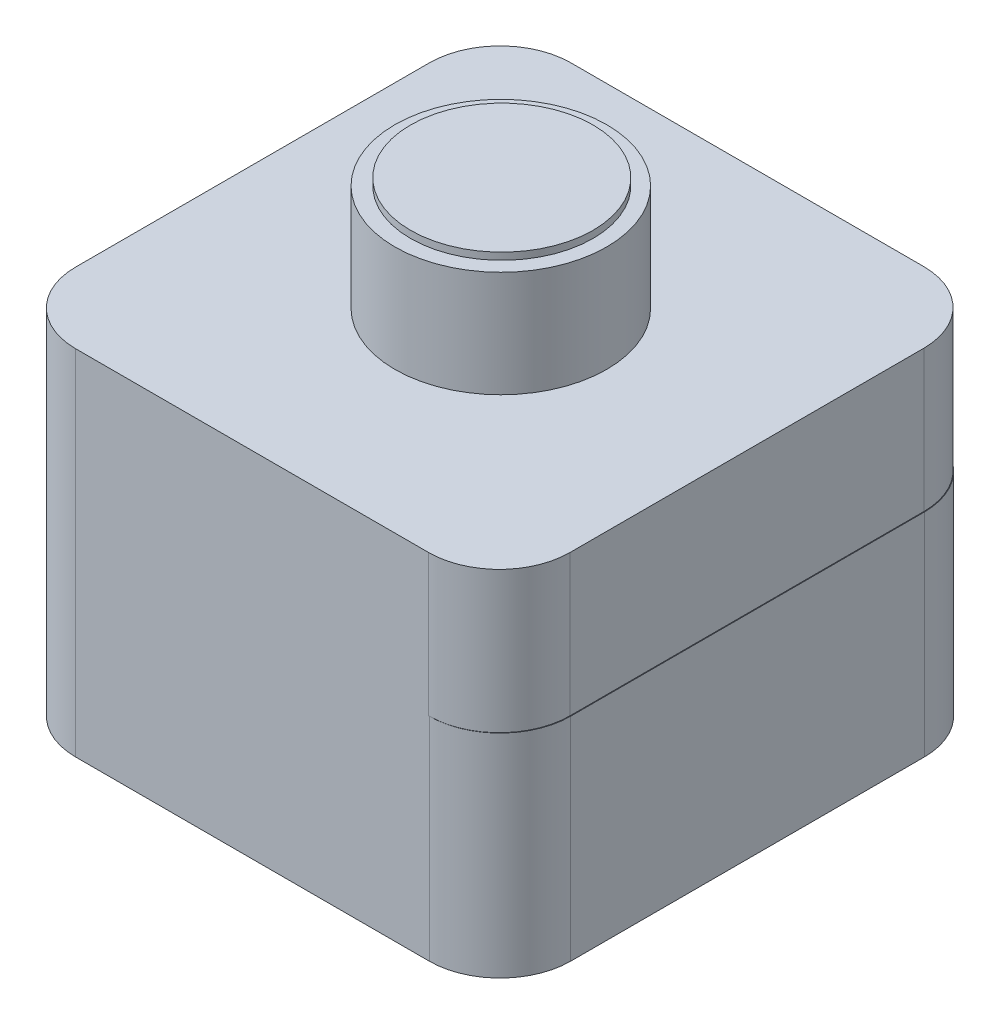
ISO-10303-21;
HEADER;
FILE_DESCRIPTION(('STEP AP214'),'2;1');
FILE_NAME('part.step','',(''),(''),'','','');
FILE_SCHEMA(('AUTOMOTIVE_DESIGN { 1 0 10303 214 1 1 1 1 }'));
ENDSEC;
DATA;
#1=APPLICATION_CONTEXT('core data for automotive mechanical design processes');
#2=APPLICATION_PROTOCOL_DEFINITION('international standard','automotive_design',2000,#1);
#3=PRODUCT_CONTEXT('',#1,'mechanical');
#4=PRODUCT('Part','Part','',(#3));
#5=PRODUCT_RELATED_PRODUCT_CATEGORY('part','',(#4));
#6=PRODUCT_DEFINITION_FORMATION('','',#4);
#7=PRODUCT_DEFINITION_CONTEXT('part definition',#1,'design');
#8=PRODUCT_DEFINITION('design','',#6,#7);
#9=PRODUCT_DEFINITION_SHAPE('','',#8);
#10=(LENGTH_UNIT() NAMED_UNIT(*) SI_UNIT(.MILLI.,.METRE.));
#11=(NAMED_UNIT(*) PLANE_ANGLE_UNIT() SI_UNIT($,.RADIAN.));
#12=(NAMED_UNIT(*) SI_UNIT($,.STERADIAN.) SOLID_ANGLE_UNIT());
#13=UNCERTAINTY_MEASURE_WITH_UNIT(LENGTH_MEASURE(1.E-05),#10,'distance_accuracy_value','');
#14=(GEOMETRIC_REPRESENTATION_CONTEXT(3) GLOBAL_UNCERTAINTY_ASSIGNED_CONTEXT((#13)) GLOBAL_UNIT_ASSIGNED_CONTEXT((#10,
#11,#12)) REPRESENTATION_CONTEXT('',''));
#15=CARTESIAN_POINT('',(0.,0.,0.));
#16=DIRECTION('',(0.,0.,1.));
#17=DIRECTION('',(1.,0.,0.));
#18=AXIS2_PLACEMENT_3D('',#15,#16,#17);
#19=CARTESIAN_POINT('',(60.,30.,-10.));
#20=DIRECTION('',(0.,-1.,0.));
#21=DIRECTION('',(0.,0.,-1.));
#22=AXIS2_PLACEMENT_3D('',#19,#20,#21);
#23=CYLINDRICAL_SURFACE('',#22,10.);
#24=CARTESIAN_POINT('',(60.,0.,-10.));
#25=DIRECTION('',(0.,1.,0.));
#26=DIRECTION('',(0.,0.,1.));
#27=AXIS2_PLACEMENT_3D('',#24,#25,#26);
#28=CIRCLE('',#27,10.);
#29=CARTESIAN_POINT('',(59.9999999999999,0.,0.));
#30=VERTEX_POINT('',#29);
#31=CARTESIAN_POINT('',(70.,0.,-10.0000000000001));
#32=VERTEX_POINT('',#31);
#33=EDGE_CURVE('E167',#30,#32,#28,.T.);
#34=ORIENTED_EDGE('',*,*,#33,.T.);
#35=DIRECTION('',(0.,-1.,0.));
#36=VECTOR('',#35,1.);
#37=CARTESIAN_POINT('',(70.,30.,-10.0000000000001));
#38=LINE('',#37,#36);
#39=CARTESIAN_POINT('',(70.,30.,-10.0000000000001));
#40=VERTEX_POINT('',#39);
#41=EDGE_CURVE('E44',#40,#32,#38,.T.);
#42=ORIENTED_EDGE('',*,*,#41,.F.);
#43=CARTESIAN_POINT('',(60.,30.,-10.));
#44=DIRECTION('',(0.,1.,0.));
#45=DIRECTION('',(0.,0.,1.));
#46=AXIS2_PLACEMENT_3D('',#43,#44,#45);
#47=CIRCLE('',#46,10.);
#48=CARTESIAN_POINT('',(59.9999999999999,30.,0.));
#49=VERTEX_POINT('',#48);
#50=EDGE_CURVE('E176',#49,#40,#47,.T.);
#51=ORIENTED_EDGE('',*,*,#50,.F.);
#52=DIRECTION('',(0.,-1.,0.));
#53=VECTOR('',#52,1.);
#54=CARTESIAN_POINT('',(59.9999999999999,30.,0.));
#55=LINE('',#54,#53);
#56=EDGE_CURVE('E193',#49,#30,#55,.T.);
#57=ORIENTED_EDGE('',*,*,#56,.T.);
#58=EDGE_LOOP('',(#34,#42,#51,#57));
#59=FACE_BOUND('',#58,.T.);
#60=ADVANCED_FACE('F41',(#59),#23,.T.);
#61=CARTESIAN_POINT('',(70.,30.,-10.0000000000001));
#62=DIRECTION('',(-1.,0.,0.));
#63=DIRECTION('',(0.,0.,1.));
#64=AXIS2_PLACEMENT_3D('',#61,#62,#63);
#65=PLANE('',#64);
#66=DIRECTION('',(0.,0.,-1.));
#67=VECTOR('',#66,1.);
#68=CARTESIAN_POINT('',(70.,0.,-10.0000000000001));
#69=LINE('',#68,#67);
#70=CARTESIAN_POINT('',(70.,0.,-59.9999999999999));
#71=VERTEX_POINT('',#70);
#72=EDGE_CURVE('E170',#32,#71,#69,.T.);
#73=ORIENTED_EDGE('',*,*,#72,.T.);
#74=DIRECTION('',(0.,-1.,0.));
#75=VECTOR('',#74,1.);
#76=CARTESIAN_POINT('',(70.,30.,-59.9999999999999));
#77=LINE('',#76,#75);
#78=CARTESIAN_POINT('',(70.,30.,-59.9999999999999));
#79=VERTEX_POINT('',#78);
#80=EDGE_CURVE('E223',#79,#71,#77,.T.);
#81=ORIENTED_EDGE('',*,*,#80,.F.);
#82=DIRECTION('',(0.,0.,-1.));
#83=VECTOR('',#82,1.);
#84=CARTESIAN_POINT('',(70.,30.,-10.0000000000001));
#85=LINE('',#84,#83);
#86=EDGE_CURVE('E179',#40,#79,#85,.T.);
#87=ORIENTED_EDGE('',*,*,#86,.F.);
#88=ORIENTED_EDGE('',*,*,#41,.T.);
#89=EDGE_LOOP('',(#73,#81,#87,#88));
#90=FACE_BOUND('',#89,.T.);
#91=ADVANCED_FACE('F305',(#90),#65,.F.);
#92=CARTESIAN_POINT('',(60.,30.,-60.));
#93=DIRECTION('',(0.,-1.,0.));
#94=DIRECTION('',(0.,0.,-1.));
#95=AXIS2_PLACEMENT_3D('',#92,#93,#94);
#96=CYLINDRICAL_SURFACE('',#95,9.99999999999999);
#97=CARTESIAN_POINT('',(60.,0.,-60.));
#98=DIRECTION('',(0.,1.,0.));
#99=DIRECTION('',(0.,0.,-1.));
#100=AXIS2_PLACEMENT_3D('',#97,#98,#99);
#101=CIRCLE('',#100,9.99999999999999);
#102=CARTESIAN_POINT('',(59.9999999999999,0.,-70.));
#103=VERTEX_POINT('',#102);
#104=EDGE_CURVE('E196',#71,#103,#101,.T.);
#105=ORIENTED_EDGE('',*,*,#104,.T.);
#106=DIRECTION('',(0.,-1.,0.));
#107=VECTOR('',#106,1.);
#108=CARTESIAN_POINT('',(59.9999999999999,30.,-70.));
#109=LINE('',#108,#107);
#110=CARTESIAN_POINT('',(59.9999999999999,30.,-70.));
#111=VERTEX_POINT('',#110);
#112=EDGE_CURVE('E221',#111,#103,#109,.T.);
#113=ORIENTED_EDGE('',*,*,#112,.F.);
#114=CARTESIAN_POINT('',(60.,30.,-60.));
#115=DIRECTION('',(0.,1.,0.));
#116=DIRECTION('',(0.,0.,-1.));
#117=AXIS2_PLACEMENT_3D('',#114,#115,#116);
#118=CIRCLE('',#117,9.99999999999999);
#119=CARTESIAN_POINT('',(62.2621964023049,30.,-69.7407631855722));
#120=VERTEX_POINT('',#119);
#121=EDGE_CURVE('E182',#120,#111,#118,.T.);
#122=ORIENTED_EDGE('',*,*,#121,.F.);
#123=EDGE_CURVE('E183',#79,#120,#118,.T.);
#124=ORIENTED_EDGE('',*,*,#123,.F.);
#125=ORIENTED_EDGE('',*,*,#80,.T.);
#126=EDGE_LOOP('',(#105,#113,#122,#124,#125));
#127=FACE_BOUND('',#126,.T.);
#128=ADVANCED_FACE('F306',(#127),#96,.T.);
#129=CARTESIAN_POINT('',(10.0000000000001,30.,-70.));
#130=DIRECTION('',(0.,0.,1.));
#131=DIRECTION('',(1.,0.,0.));
#132=AXIS2_PLACEMENT_3D('',#129,#130,#131);
#133=PLANE('',#132);
#134=DIRECTION('',(-1.,0.,0.));
#135=VECTOR('',#134,1.);
#136=CARTESIAN_POINT('',(10.0000000000001,0.,-70.));
#137=LINE('',#136,#135);
#138=CARTESIAN_POINT('',(10.,0.,-70.));
#139=VERTEX_POINT('',#138);
#140=EDGE_CURVE('E198',#103,#139,#137,.T.);
#141=ORIENTED_EDGE('',*,*,#140,.T.);
#142=DIRECTION('',(0.,-1.,0.));
#143=VECTOR('',#142,1.);
#144=CARTESIAN_POINT('',(10.,30.,-70.));
#145=LINE('',#144,#143);
#146=CARTESIAN_POINT('',(10.,30.,-70.));
#147=VERTEX_POINT('',#146);
#148=EDGE_CURVE('E218',#147,#139,#145,.T.);
#149=ORIENTED_EDGE('',*,*,#148,.F.);
#150=DIRECTION('',(-1.,0.,0.));
#151=VECTOR('',#150,1.);
#152=CARTESIAN_POINT('',(10.0000000000001,30.,-70.));
#153=LINE('',#152,#151);
#154=EDGE_CURVE('E186',#111,#147,#153,.T.);
#155=ORIENTED_EDGE('',*,*,#154,.F.);
#156=ORIENTED_EDGE('',*,*,#112,.T.);
#157=EDGE_LOOP('',(#141,#149,#155,#156));
#158=FACE_BOUND('',#157,.T.);
#159=ADVANCED_FACE('F310',(#158),#133,.F.);
#160=CARTESIAN_POINT('',(10.,30.,-60.));
#161=DIRECTION('',(0.,-1.,0.));
#162=DIRECTION('',(0.,0.,-1.));
#163=AXIS2_PLACEMENT_3D('',#160,#161,#162);
#164=CYLINDRICAL_SURFACE('',#163,10.);
#165=CARTESIAN_POINT('',(10.,0.,-60.));
#166=DIRECTION('',(0.,1.,0.));
#167=DIRECTION('',(0.,0.,-1.));
#168=AXIS2_PLACEMENT_3D('',#165,#166,#167);
#169=CIRCLE('',#168,10.);
#170=CARTESIAN_POINT('',(0.,0.,-59.9999999999999));
#171=VERTEX_POINT('',#170);
#172=EDGE_CURVE('E200',#139,#171,#169,.T.);
#173=ORIENTED_EDGE('',*,*,#172,.T.);
#174=DIRECTION('',(0.,-1.,0.));
#175=VECTOR('',#174,1.);
#176=CARTESIAN_POINT('',(0.,30.,-59.9999999999999));
#177=LINE('',#176,#175);
#178=CARTESIAN_POINT('',(0.,30.,-59.9999999999999));
#179=VERTEX_POINT('',#178);
#180=EDGE_CURVE('E215',#179,#171,#177,.T.);
#181=ORIENTED_EDGE('',*,*,#180,.F.);
#182=CARTESIAN_POINT('',(10.,30.,-60.));
#183=DIRECTION('',(0.,1.,0.));
#184=DIRECTION('',(0.,0.,-1.));
#185=AXIS2_PLACEMENT_3D('',#182,#183,#184);
#186=CIRCLE('',#185,10.);
#187=EDGE_CURVE('E189',#147,#179,#186,.T.);
#188=ORIENTED_EDGE('',*,*,#187,.F.);
#189=ORIENTED_EDGE('',*,*,#148,.T.);
#190=EDGE_LOOP('',(#173,#181,#188,#189));
#191=FACE_BOUND('',#190,.T.);
#192=ADVANCED_FACE('F314',(#191),#164,.T.);
#193=CARTESIAN_POINT('',(0.,30.,-10.0000000000001));
#194=DIRECTION('',(1.,0.,0.));
#195=DIRECTION('',(0.,0.,-1.));
#196=AXIS2_PLACEMENT_3D('',#193,#194,#195);
#197=PLANE('',#196);
#198=DIRECTION('',(0.,0.,1.));
#199=VECTOR('',#198,1.);
#200=CARTESIAN_POINT('',(0.,0.,-10.0000000000001));
#201=LINE('',#200,#199);
#202=CARTESIAN_POINT('',(0.,0.,-10.0000000000001));
#203=VERTEX_POINT('',#202);
#204=EDGE_CURVE('E202',#171,#203,#201,.T.);
#205=ORIENTED_EDGE('',*,*,#204,.T.);
#206=DIRECTION('',(0.,-1.,0.));
#207=VECTOR('',#206,1.);
#208=CARTESIAN_POINT('',(0.,30.,-10.0000000000001));
#209=LINE('',#208,#207);
#210=CARTESIAN_POINT('',(0.,50.,-10.0000000000001));
#211=VERTEX_POINT('',#210);
#212=EDGE_CURVE('E212',#211,#203,#209,.T.);
#213=ORIENTED_EDGE('',*,*,#212,.F.);
#214=DIRECTION('',(0.,0.,1.));
#215=VECTOR('',#214,1.);
#216=CARTESIAN_POINT('',(0.,50.,-10.0000000000001));
#217=LINE('',#216,#215);
#218=CARTESIAN_POINT('',(0.,50.,-60.0226764486462));
#219=VERTEX_POINT('',#218);
#220=EDGE_CURVE('E244',#219,#211,#217,.T.);
#221=ORIENTED_EDGE('',*,*,#220,.F.);
#222=DIRECTION('',(0.,-1.,0.));
#223=VECTOR('',#222,1.);
#224=CARTESIAN_POINT('',(0.,50.,-60.0226764486462));
#225=LINE('',#224,#223);
#226=CARTESIAN_POINT('',(0.,30.,-60.0226764486462));
#227=VERTEX_POINT('',#226);
#228=EDGE_CURVE('E264',#219,#227,#225,.T.);
#229=ORIENTED_EDGE('',*,*,#228,.T.);
#230=DIRECTION('',(0.,0.,1.));
#231=VECTOR('',#230,1.);
#232=CARTESIAN_POINT('',(0.,30.,-10.0000000000001));
#233=LINE('',#232,#231);
#234=EDGE_CURVE('E164',#227,#179,#233,.T.);
#235=ORIENTED_EDGE('',*,*,#234,.T.);
#236=ORIENTED_EDGE('',*,*,#180,.T.);
#237=EDGE_LOOP('',(#205,#213,#221,#229,#235,#236));
#238=FACE_BOUND('',#237,.T.);
#239=ADVANCED_FACE('F289',(#238),#197,.F.);
#240=CARTESIAN_POINT('',(10.,30.,-10.));
#241=DIRECTION('',(0.,-1.,0.));
#242=DIRECTION('',(0.,0.,-1.));
#243=AXIS2_PLACEMENT_3D('',#240,#241,#242);
#244=CYLINDRICAL_SURFACE('',#243,10.);
#245=CARTESIAN_POINT('',(10.,0.,-10.));
#246=DIRECTION('',(0.,1.,0.));
#247=DIRECTION('',(0.,0.,-1.));
#248=AXIS2_PLACEMENT_3D('',#245,#246,#247);
#249=CIRCLE('',#248,10.);
#250=CARTESIAN_POINT('',(10.0000000000001,0.,0.));
#251=VERTEX_POINT('',#250);
#252=EDGE_CURVE('E204',#203,#251,#249,.T.);
#253=ORIENTED_EDGE('',*,*,#252,.T.);
#254=DIRECTION('',(0.,-1.,0.));
#255=VECTOR('',#254,1.);
#256=CARTESIAN_POINT('',(10.0000000000001,30.,0.));
#257=LINE('',#256,#255);
#258=CARTESIAN_POINT('',(10.0000000000001,50.,0.));
#259=VERTEX_POINT('',#258);
#260=EDGE_CURVE('E209',#259,#251,#257,.T.);
#261=ORIENTED_EDGE('',*,*,#260,.F.);
#262=CARTESIAN_POINT('',(10.,50.,-10.));
#263=DIRECTION('',(0.,1.,0.));
#264=DIRECTION('',(0.,0.,-1.));
#265=AXIS2_PLACEMENT_3D('',#262,#263,#264);
#266=CIRCLE('',#265,10.);
#267=EDGE_CURVE('E247',#211,#259,#266,.T.);
#268=ORIENTED_EDGE('',*,*,#267,.F.);
#269=ORIENTED_EDGE('',*,*,#212,.T.);
#270=EDGE_LOOP('',(#253,#261,#268,#269));
#271=FACE_BOUND('',#270,.T.);
#272=ADVANCED_FACE('F292',(#271),#244,.T.);
#273=CARTESIAN_POINT('',(10.0000000000001,30.,0.));
#274=DIRECTION('',(0.,0.,-1.));
#275=DIRECTION('',(-1.,0.,0.));
#276=AXIS2_PLACEMENT_3D('',#273,#274,#275);
#277=PLANE('',#276);
#278=DIRECTION('',(1.,0.,0.));
#279=VECTOR('',#278,1.);
#280=CARTESIAN_POINT('',(10.0000000000001,0.,0.));
#281=LINE('',#280,#279);
#282=EDGE_CURVE('E180',#251,#30,#281,.T.);
#283=ORIENTED_EDGE('',*,*,#282,.T.);
#284=ORIENTED_EDGE('',*,*,#56,.F.);
#285=DIRECTION('',(1.,0.,0.));
#286=VECTOR('',#285,1.);
#287=CARTESIAN_POINT('',(10.0000000000001,30.,0.));
#288=LINE('',#287,#286);
#289=CARTESIAN_POINT('',(59.9044877320947,30.,0.));
#290=VERTEX_POINT('',#289);
#291=EDGE_CURVE('E192',#290,#49,#288,.T.);
#292=ORIENTED_EDGE('',*,*,#291,.F.);
#293=DIRECTION('',(0.,-1.,0.));
#294=VECTOR('',#293,1.);
#295=CARTESIAN_POINT('',(59.9044877320947,50.,0.));
#296=LINE('',#295,#294);
#297=CARTESIAN_POINT('',(59.9044877320947,50.,0.));
#298=VERTEX_POINT('',#297);
#299=EDGE_CURVE('E250',#298,#290,#296,.T.);
#300=ORIENTED_EDGE('',*,*,#299,.F.);
#301=DIRECTION('',(1.,0.,0.));
#302=VECTOR('',#301,1.);
#303=CARTESIAN_POINT('',(10.0000000000001,50.,0.));
#304=LINE('',#303,#302);
#305=EDGE_CURVE('E160',#259,#298,#304,.T.);
#306=ORIENTED_EDGE('',*,*,#305,.F.);
#307=ORIENTED_EDGE('',*,*,#260,.T.);
#308=EDGE_LOOP('',(#283,#284,#292,#300,#306,#307));
#309=FACE_BOUND('',#308,.T.);
#310=ADVANCED_FACE('F296',(#309),#277,.F.);
#311=CARTESIAN_POINT('',(60.,30.,-10.));
#312=DIRECTION('',(0.,1.,0.));
#313=DIRECTION('',(0.,0.,1.));
#314=AXIS2_PLACEMENT_3D('',#311,#312,#313);
#315=PLANE('',#314);
#316=CARTESIAN_POINT('',(59.9044877320947,30.,-10.));
#317=DIRECTION('',(0.,1.,0.));
#318=DIRECTION('',(0.,0.,1.));
#319=AXIS2_PLACEMENT_3D('',#316,#317,#318);
#320=CIRCLE('',#319,10.);
#321=CARTESIAN_POINT('',(69.9044877320947,30.,-10.0000000000001));
#322=VERTEX_POINT('',#321);
#323=EDGE_CURVE('E62',#290,#322,#320,.T.);
#324=ORIENTED_EDGE('',*,*,#323,.F.);
#325=ORIENTED_EDGE('',*,*,#291,.T.);
#326=ORIENTED_EDGE('',*,*,#50,.T.);
#327=ORIENTED_EDGE('',*,*,#86,.T.);
#328=ORIENTED_EDGE('',*,*,#123,.T.);
#329=CARTESIAN_POINT('',(59.9044877320947,30.,-60.0226764486463));
#330=DIRECTION('',(0.,1.,0.));
#331=DIRECTION('',(0.,0.,-1.));
#332=AXIS2_PLACEMENT_3D('',#329,#330,#331);
#333=CIRCLE('',#332,9.99999999999999);
#334=CARTESIAN_POINT('',(69.9044877320947,30.,-60.0226764486462));
#335=VERTEX_POINT('',#334);
#336=EDGE_CURVE('E254',#335,#120,#333,.T.);
#337=ORIENTED_EDGE('',*,*,#336,.F.);
#338=DIRECTION('',(0.,0.,-1.));
#339=VECTOR('',#338,1.);
#340=CARTESIAN_POINT('',(69.9044877320947,30.,-10.0000000000001));
#341=LINE('',#340,#339);
#342=EDGE_CURVE('E57',#322,#335,#341,.T.);
#343=ORIENTED_EDGE('',*,*,#342,.F.);
#344=EDGE_LOOP('',(#324,#325,#326,#327,#328,#337,#343));
#345=FACE_BOUND('',#344,.T.);
#346=ADVANCED_FACE('F304',(#345),#315,.T.);
#347=CARTESIAN_POINT('',(60.,0.,-10.));
#348=DIRECTION('',(0.,1.,0.));
#349=DIRECTION('',(0.,0.,1.));
#350=AXIS2_PLACEMENT_3D('',#347,#348,#349);
#351=PLANE('',#350);
#352=ORIENTED_EDGE('',*,*,#33,.F.);
#353=ORIENTED_EDGE('',*,*,#282,.F.);
#354=ORIENTED_EDGE('',*,*,#252,.F.);
#355=ORIENTED_EDGE('',*,*,#204,.F.);
#356=ORIENTED_EDGE('',*,*,#172,.F.);
#357=ORIENTED_EDGE('',*,*,#140,.F.);
#358=ORIENTED_EDGE('',*,*,#104,.F.);
#359=ORIENTED_EDGE('',*,*,#72,.F.);
#360=EDGE_LOOP('',(#352,#353,#354,#355,#356,#357,#358,#359));
#361=FACE_BOUND('',#360,.T.);
#362=ADVANCED_FACE('F300',(#361),#351,.F.);
#363=CARTESIAN_POINT('',(59.9044877320947,30.,-10.));
#364=DIRECTION('',(0.,1.,0.));
#365=DIRECTION('',(0.,0.,1.));
#366=AXIS2_PLACEMENT_3D('',#363,#364,#365);
#367=PLANE('',#366);
#368=CARTESIAN_POINT('',(59.9044877320947,30.,-70.0226764486463));
#369=VERTEX_POINT('',#368);
#370=EDGE_CURVE('E253',#120,#369,#333,.T.);
#371=ORIENTED_EDGE('',*,*,#370,.F.);
#372=ORIENTED_EDGE('',*,*,#121,.T.);
#373=ORIENTED_EDGE('',*,*,#154,.T.);
#374=ORIENTED_EDGE('',*,*,#187,.T.);
#375=ORIENTED_EDGE('',*,*,#234,.F.);
#376=CARTESIAN_POINT('',(10.,30.,-60.0226764486463));
#377=DIRECTION('',(0.,1.,0.));
#378=DIRECTION('',(0.,0.,-1.));
#379=AXIS2_PLACEMENT_3D('',#376,#377,#378);
#380=CIRCLE('',#379,10.);
#381=CARTESIAN_POINT('',(10.,30.,-70.0226764486463));
#382=VERTEX_POINT('',#381);
#383=EDGE_CURVE('E259',#382,#227,#380,.T.);
#384=ORIENTED_EDGE('',*,*,#383,.F.);
#385=DIRECTION('',(-1.,0.,0.));
#386=VECTOR('',#385,1.);
#387=CARTESIAN_POINT('',(10.0000000000001,30.,-70.0226764486463));
#388=LINE('',#387,#386);
#389=EDGE_CURVE('E257',#369,#382,#388,.T.);
#390=ORIENTED_EDGE('',*,*,#389,.F.);
#391=EDGE_LOOP('',(#371,#372,#373,#374,#375,#384,#390));
#392=FACE_BOUND('',#391,.T.);
#393=ADVANCED_FACE('F280',(#392),#367,.F.);
#394=CARTESIAN_POINT('',(59.9044877320947,50.,-10.));
#395=DIRECTION('',(0.,-1.,0.));
#396=DIRECTION('',(0.,0.,-1.));
#397=AXIS2_PLACEMENT_3D('',#394,#395,#396);
#398=CYLINDRICAL_SURFACE('',#397,10.);
#399=ORIENTED_EDGE('',*,*,#323,.T.);
#400=DIRECTION('',(0.,-1.,0.));
#401=VECTOR('',#400,1.);
#402=CARTESIAN_POINT('',(69.9044877320947,50.,-10.0000000000001));
#403=LINE('',#402,#401);
#404=CARTESIAN_POINT('',(69.9044877320947,50.,-10.0000000000001));
#405=VERTEX_POINT('',#404);
#406=EDGE_CURVE('E148',#405,#322,#403,.T.);
#407=ORIENTED_EDGE('',*,*,#406,.F.);
#408=CARTESIAN_POINT('',(59.9044877320947,50.,-10.));
#409=DIRECTION('',(0.,1.,0.));
#410=DIRECTION('',(0.,0.,1.));
#411=AXIS2_PLACEMENT_3D('',#408,#409,#410);
#412=CIRCLE('',#411,10.);
#413=EDGE_CURVE('E154',#298,#405,#412,.T.);
#414=ORIENTED_EDGE('',*,*,#413,.F.);
#415=ORIENTED_EDGE('',*,*,#299,.T.);
#416=EDGE_LOOP('',(#399,#407,#414,#415));
#417=FACE_BOUND('',#416,.T.);
#418=ADVANCED_FACE('F166',(#417),#398,.T.);
#419=CARTESIAN_POINT('',(69.9044877320947,50.,-10.0000000000001));
#420=DIRECTION('',(-1.,0.,0.));
#421=DIRECTION('',(0.,0.,1.));
#422=AXIS2_PLACEMENT_3D('',#419,#420,#421);
#423=PLANE('',#422);
#424=ORIENTED_EDGE('',*,*,#342,.T.);
#425=DIRECTION('',(0.,-1.,0.));
#426=VECTOR('',#425,1.);
#427=CARTESIAN_POINT('',(69.9044877320947,50.,-60.0226764486462));
#428=LINE('',#427,#426);
#429=CARTESIAN_POINT('',(69.9044877320947,50.,-60.0226764486462));
#430=VERTEX_POINT('',#429);
#431=EDGE_CURVE('E150',#430,#335,#428,.T.);
#432=ORIENTED_EDGE('',*,*,#431,.F.);
#433=DIRECTION('',(0.,0.,-1.));
#434=VECTOR('',#433,1.);
#435=CARTESIAN_POINT('',(69.9044877320947,50.,-10.0000000000001));
#436=LINE('',#435,#434);
#437=EDGE_CURVE('E144',#405,#430,#436,.T.);
#438=ORIENTED_EDGE('',*,*,#437,.F.);
#439=ORIENTED_EDGE('',*,*,#406,.T.);
#440=EDGE_LOOP('',(#424,#432,#438,#439));
#441=FACE_BOUND('',#440,.T.);
#442=ADVANCED_FACE('F146',(#441),#423,.F.);
#443=CARTESIAN_POINT('',(59.9044877320947,50.,-60.0226764486463));
#444=DIRECTION('',(0.,-1.,0.));
#445=DIRECTION('',(0.,0.,-1.));
#446=AXIS2_PLACEMENT_3D('',#443,#444,#445);
#447=CYLINDRICAL_SURFACE('',#446,9.99999999999999);
#448=ORIENTED_EDGE('',*,*,#336,.T.);
#449=ORIENTED_EDGE('',*,*,#370,.T.);
#450=DIRECTION('',(0.,-1.,0.));
#451=VECTOR('',#450,1.);
#452=CARTESIAN_POINT('',(59.9044877320947,50.,-70.0226764486463));
#453=LINE('',#452,#451);
#454=CARTESIAN_POINT('',(59.9044877320947,50.,-70.0226764486463));
#455=VERTEX_POINT('',#454);
#456=EDGE_CURVE('E172',#455,#369,#453,.T.);
#457=ORIENTED_EDGE('',*,*,#456,.F.);
#458=CARTESIAN_POINT('',(59.9044877320947,50.,-60.0226764486463));
#459=DIRECTION('',(0.,1.,0.));
#460=DIRECTION('',(0.,0.,-1.));
#461=AXIS2_PLACEMENT_3D('',#458,#459,#460);
#462=CIRCLE('',#461,9.99999999999999);
#463=EDGE_CURVE('E153',#430,#455,#462,.T.);
#464=ORIENTED_EDGE('',*,*,#463,.F.);
#465=ORIENTED_EDGE('',*,*,#431,.T.);
#466=EDGE_LOOP('',(#448,#449,#457,#464,#465));
#467=FACE_BOUND('',#466,.T.);
#468=ADVANCED_FACE('F429',(#467),#447,.T.);
#469=CARTESIAN_POINT('',(10.0000000000001,50.,-70.0226764486463));
#470=DIRECTION('',(0.,0.,1.));
#471=DIRECTION('',(1.,0.,0.));
#472=AXIS2_PLACEMENT_3D('',#469,#470,#471);
#473=PLANE('',#472);
#474=ORIENTED_EDGE('',*,*,#389,.T.);
#475=DIRECTION('',(0.,-1.,0.));
#476=VECTOR('',#475,1.);
#477=CARTESIAN_POINT('',(10.,50.,-70.0226764486463));
#478=LINE('',#477,#476);
#479=CARTESIAN_POINT('',(10.,50.,-70.0226764486463));
#480=VERTEX_POINT('',#479);
#481=EDGE_CURVE('E267',#480,#382,#478,.T.);
#482=ORIENTED_EDGE('',*,*,#481,.F.);
#483=DIRECTION('',(-1.,0.,0.));
#484=VECTOR('',#483,1.);
#485=CARTESIAN_POINT('',(10.0000000000001,50.,-70.0226764486463));
#486=LINE('',#485,#484);
#487=EDGE_CURVE('E240',#455,#480,#486,.T.);
#488=ORIENTED_EDGE('',*,*,#487,.F.);
#489=ORIENTED_EDGE('',*,*,#456,.T.);
#490=EDGE_LOOP('',(#474,#482,#488,#489));
#491=FACE_BOUND('',#490,.T.);
#492=ADVANCED_FACE('F274',(#491),#473,.F.);
#493=CARTESIAN_POINT('',(10.,50.,-60.0226764486463));
#494=DIRECTION('',(0.,-1.,0.));
#495=DIRECTION('',(0.,0.,-1.));
#496=AXIS2_PLACEMENT_3D('',#493,#494,#495);
#497=CYLINDRICAL_SURFACE('',#496,10.);
#498=ORIENTED_EDGE('',*,*,#383,.T.);
#499=ORIENTED_EDGE('',*,*,#228,.F.);
#500=CARTESIAN_POINT('',(10.,50.,-60.0226764486463));
#501=DIRECTION('',(0.,1.,0.));
#502=DIRECTION('',(0.,0.,-1.));
#503=AXIS2_PLACEMENT_3D('',#500,#501,#502);
#504=CIRCLE('',#503,10.);
#505=EDGE_CURVE('E242',#480,#219,#504,.T.);
#506=ORIENTED_EDGE('',*,*,#505,.F.);
#507=ORIENTED_EDGE('',*,*,#481,.T.);
#508=EDGE_LOOP('',(#498,#499,#506,#507));
#509=FACE_BOUND('',#508,.T.);
#510=ADVANCED_FACE('F285',(#509),#497,.T.);
#511=CARTESIAN_POINT('',(59.9044877320947,50.,-10.));
#512=DIRECTION('',(0.,1.,0.));
#513=DIRECTION('',(0.,0.,1.));
#514=AXIS2_PLACEMENT_3D('',#511,#512,#513);
#515=PLANE('',#514);
#516=CARTESIAN_POINT('',(35.1090689586004,50.,-35.0083762668561));
#517=DIRECTION('',(0.,1.,0.));
#518=DIRECTION('',(0.,0.,1.));
#519=AXIS2_PLACEMENT_3D('',#516,#517,#518);
#520=CIRCLE('',#519,14.9775423280981);
#521=CARTESIAN_POINT('',(35.1090689586004,50.,-20.030833938758));
#522=VERTEX_POINT('',#521);
#523=EDGE_CURVE('E49',#522,#522,#520,.T.);
#524=ORIENTED_EDGE('',*,*,#523,.F.);
#525=EDGE_LOOP('',(#524));
#526=FACE_BOUND('',#525,.T.);
#527=ORIENTED_EDGE('',*,*,#413,.T.);
#528=ORIENTED_EDGE('',*,*,#437,.T.);
#529=ORIENTED_EDGE('',*,*,#463,.T.);
#530=ORIENTED_EDGE('',*,*,#487,.T.);
#531=ORIENTED_EDGE('',*,*,#505,.T.);
#532=ORIENTED_EDGE('',*,*,#220,.T.);
#533=ORIENTED_EDGE('',*,*,#267,.T.);
#534=ORIENTED_EDGE('',*,*,#305,.T.);
#535=EDGE_LOOP('',(#527,#528,#529,#530,#531,#532,#533,#534));
#536=FACE_BOUND('',#535,.T.);
#537=ADVANCED_FACE('F157',(#526,#536),#515,.T.);
#538=CARTESIAN_POINT('',(35.1090689586004,65.,-35.0083762668561));
#539=DIRECTION('',(0.,-1.,0.));
#540=DIRECTION('',(0.,0.,-1.));
#541=AXIS2_PLACEMENT_3D('',#538,#539,#540);
#542=CYLINDRICAL_SURFACE('',#541,14.9775423280981);
#543=CARTESIAN_POINT('',(35.1090689586004,65.,-35.0083762668561));
#544=DIRECTION('',(0.,1.,0.));
#545=DIRECTION('',(0.,0.,1.));
#546=AXIS2_PLACEMENT_3D('',#543,#544,#545);
#547=CIRCLE('',#546,14.9775423280981);
#548=CARTESIAN_POINT('',(35.1090689586004,65.,-20.030833938758));
#549=VERTEX_POINT('',#548);
#550=EDGE_CURVE('E237',#549,#549,#547,.T.);
#551=ORIENTED_EDGE('',*,*,#550,.F.);
#552=EDGE_LOOP('',(#551));
#553=FACE_BOUND('',#552,.T.);
#554=ORIENTED_EDGE('',*,*,#523,.T.);
#555=EDGE_LOOP('',(#554));
#556=FACE_BOUND('',#555,.T.);
#557=ADVANCED_FACE('F464',(#553,#556),#542,.T.);
#558=CARTESIAN_POINT('',(0.,65.,0.));
#559=DIRECTION('',(0.,1.,0.));
#560=DIRECTION('',(0.,0.,1.));
#561=AXIS2_PLACEMENT_3D('',#558,#559,#560);
#562=PLANE('',#561);
#563=CARTESIAN_POINT('',(35.1789800629734,65.,-35.0791082012832));
#564=DIRECTION('',(0.,1.,0.));
#565=DIRECTION('',(0.,0.,1.));
#566=AXIS2_PLACEMENT_3D('',#563,#564,#565);
#567=CIRCLE('',#566,12.9060592101266);
#568=CARTESIAN_POINT('',(35.1789800629734,65.,-22.1730489911565));
#569=VERTEX_POINT('',#568);
#570=EDGE_CURVE('E11',#569,#569,#567,.T.);
#571=ORIENTED_EDGE('',*,*,#570,.F.);
#572=EDGE_LOOP('',(#571));
#573=FACE_BOUND('',#572,.T.);
#574=ORIENTED_EDGE('',*,*,#550,.T.);
#575=EDGE_LOOP('',(#574));
#576=FACE_BOUND('',#575,.T.);
#577=ADVANCED_FACE('F474',(#573,#576),#562,.T.);
#578=CARTESIAN_POINT('',(35.1789800629734,66.,-35.0791082012832));
#579=DIRECTION('',(0.,-1.,0.));
#580=DIRECTION('',(0.,0.,-1.));
#581=AXIS2_PLACEMENT_3D('',#578,#579,#580);
#582=CYLINDRICAL_SURFACE('',#581,12.9060592101266);
#583=CARTESIAN_POINT('',(35.1789800629734,66.,-35.0791082012832));
#584=DIRECTION('',(0.,1.,0.));
#585=DIRECTION('',(0.,0.,1.));
#586=AXIS2_PLACEMENT_3D('',#583,#584,#585);
#587=CIRCLE('',#586,12.9060592101266);
#588=CARTESIAN_POINT('',(35.1789800629734,66.,-22.1730489911565));
#589=VERTEX_POINT('',#588);
#590=EDGE_CURVE('E522',#589,#589,#587,.T.);
#591=ORIENTED_EDGE('',*,*,#590,.F.);
#592=EDGE_LOOP('',(#591));
#593=FACE_BOUND('',#592,.T.);
#594=ORIENTED_EDGE('',*,*,#570,.T.);
#595=EDGE_LOOP('',(#594));
#596=FACE_BOUND('',#595,.T.);
#597=ADVANCED_FACE('F485',(#593,#596),#582,.T.);
#598=CARTESIAN_POINT('',(0.,66.,0.));
#599=DIRECTION('',(0.,1.,0.));
#600=DIRECTION('',(0.,0.,1.));
#601=AXIS2_PLACEMENT_3D('',#598,#599,#600);
#602=PLANE('',#601);
#603=ORIENTED_EDGE('',*,*,#590,.T.);
#604=EDGE_LOOP('',(#603));
#605=FACE_BOUND('',#604,.T.);
#606=ADVANCED_FACE('F496',(#605),#602,.T.);
#607=CLOSED_SHELL('',(#60,#91,#128,#159,#192,#239,#272,#310,#346,#362,#393,#418,#442,#468,#492,
#510,#537,#557,#577,#597,#606));
#608=MANIFOLD_SOLID_BREP('B2',#607);
#609=ADVANCED_BREP_SHAPE_REPRESENTATION('',(#18,#608),#14);
#610=SHAPE_DEFINITION_REPRESENTATION(#9,#609);
ENDSEC;
END-ISO-10303-21;
